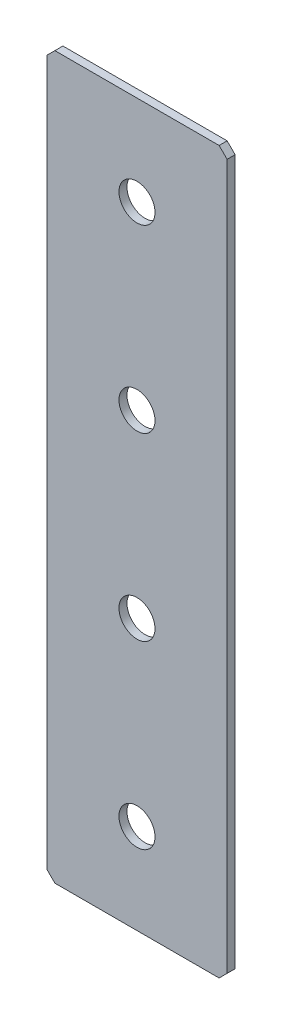
ISO-10303-21;
HEADER;
FILE_DESCRIPTION(('STEP AP214'),'2;1');
FILE_NAME('part.step','',(''),(''),'','','');
FILE_SCHEMA(('AUTOMOTIVE_DESIGN { 1 0 10303 214 1 1 1 1 }'));
ENDSEC;
DATA;
#1=APPLICATION_CONTEXT('core data for automotive mechanical design processes');
#2=APPLICATION_PROTOCOL_DEFINITION('international standard','automotive_design',2000,#1);
#3=PRODUCT_CONTEXT('',#1,'mechanical');
#4=PRODUCT('Part','Part','',(#3));
#5=PRODUCT_RELATED_PRODUCT_CATEGORY('part','',(#4));
#6=PRODUCT_DEFINITION_FORMATION('','',#4);
#7=PRODUCT_DEFINITION_CONTEXT('part definition',#1,'design');
#8=PRODUCT_DEFINITION('design','',#6,#7);
#9=PRODUCT_DEFINITION_SHAPE('','',#8);
#10=(LENGTH_UNIT() NAMED_UNIT(*) SI_UNIT(.MILLI.,.METRE.));
#11=(NAMED_UNIT(*) PLANE_ANGLE_UNIT() SI_UNIT($,.RADIAN.));
#12=(NAMED_UNIT(*) SI_UNIT($,.STERADIAN.) SOLID_ANGLE_UNIT());
#13=UNCERTAINTY_MEASURE_WITH_UNIT(LENGTH_MEASURE(1.E-05),#10,'distance_accuracy_value','');
#14=(GEOMETRIC_REPRESENTATION_CONTEXT(3) GLOBAL_UNCERTAINTY_ASSIGNED_CONTEXT((#13)) GLOBAL_UNIT_ASSIGNED_CONTEXT((#10,
#11,#12)) REPRESENTATION_CONTEXT('',''));
#15=CARTESIAN_POINT('',(0.,0.,0.));
#16=DIRECTION('',(0.,0.,1.));
#17=DIRECTION('',(1.,0.,0.));
#18=AXIS2_PLACEMENT_3D('',#15,#16,#17);
#19=CARTESIAN_POINT('',(22.5,-90.,2.));
#20=DIRECTION('',(-1.,0.,0.));
#21=DIRECTION('',(0.,0.,1.));
#22=AXIS2_PLACEMENT_3D('',#19,#20,#21);
#23=PLANE('',#22);
#24=DIRECTION('',(0.,1.,0.));
#25=VECTOR('',#24,1.);
#26=CARTESIAN_POINT('',(22.5,-90.,2.));
#27=LINE('',#26,#25);
#28=CARTESIAN_POINT('',(22.5,-88.,2.));
#29=VERTEX_POINT('',#28);
#30=CARTESIAN_POINT('',(22.5,87.9999999999999,2.));
#31=VERTEX_POINT('',#30);
#32=EDGE_CURVE('E128',#29,#31,#27,.T.);
#33=ORIENTED_EDGE('',*,*,#32,.F.);
#34=DIRECTION('',(0.,0.,-1.));
#35=VECTOR('',#34,1.);
#36=CARTESIAN_POINT('',(22.5,-88.,2.));
#37=LINE('',#36,#35);
#38=CARTESIAN_POINT('',(22.5,-88.,0.));
#39=VERTEX_POINT('',#38);
#40=EDGE_CURVE('E154',#29,#39,#37,.T.);
#41=ORIENTED_EDGE('',*,*,#40,.T.);
#42=DIRECTION('',(0.,1.,0.));
#43=VECTOR('',#42,1.);
#44=CARTESIAN_POINT('',(22.5,-90.,0.));
#45=LINE('',#44,#43);
#46=CARTESIAN_POINT('',(22.5,87.9999999999999,0.));
#47=VERTEX_POINT('',#46);
#48=EDGE_CURVE('E162',#39,#47,#45,.T.);
#49=ORIENTED_EDGE('',*,*,#48,.T.);
#50=DIRECTION('',(0.,0.,1.));
#51=VECTOR('',#50,1.);
#52=CARTESIAN_POINT('',(22.5,88.,2.));
#53=LINE('',#52,#51);
#54=EDGE_CURVE('E152',#47,#31,#53,.T.);
#55=ORIENTED_EDGE('',*,*,#54,.T.);
#56=EDGE_LOOP('',(#33,#41,#49,#55));
#57=FACE_BOUND('',#56,.T.);
#58=ADVANCED_FACE('F37',(#57),#23,.F.);
#59=CARTESIAN_POINT('',(-22.5,90.,2.));
#60=DIRECTION('',(0.,-1.,0.));
#61=DIRECTION('',(0.,0.,-1.));
#62=AXIS2_PLACEMENT_3D('',#59,#60,#61);
#63=PLANE('',#62);
#64=DIRECTION('',(-1.,0.,0.));
#65=VECTOR('',#64,1.);
#66=CARTESIAN_POINT('',(-22.5,90.,0.));
#67=LINE('',#66,#65);
#68=CARTESIAN_POINT('',(20.5,90.,0.));
#69=VERTEX_POINT('',#68);
#70=CARTESIAN_POINT('',(-20.5,90.,0.));
#71=VERTEX_POINT('',#70);
#72=EDGE_CURVE('E133',#69,#71,#67,.T.);
#73=ORIENTED_EDGE('',*,*,#72,.T.);
#74=DIRECTION('',(0.,0.,1.));
#75=VECTOR('',#74,1.);
#76=CARTESIAN_POINT('',(-20.5,90.,2.));
#77=LINE('',#76,#75);
#78=CARTESIAN_POINT('',(-20.5,90.,2.));
#79=VERTEX_POINT('',#78);
#80=EDGE_CURVE('E11',#71,#79,#77,.T.);
#81=ORIENTED_EDGE('',*,*,#80,.T.);
#82=DIRECTION('',(-1.,0.,0.));
#83=VECTOR('',#82,1.);
#84=CARTESIAN_POINT('',(-22.5,90.,2.));
#85=LINE('',#84,#83);
#86=CARTESIAN_POINT('',(20.5,90.,2.));
#87=VERTEX_POINT('',#86);
#88=EDGE_CURVE('E131',#87,#79,#85,.T.);
#89=ORIENTED_EDGE('',*,*,#88,.F.);
#90=DIRECTION('',(0.,0.,-1.));
#91=VECTOR('',#90,1.);
#92=CARTESIAN_POINT('',(20.5,90.,2.));
#93=LINE('',#92,#91);
#94=EDGE_CURVE('E45',#87,#69,#93,.T.);
#95=ORIENTED_EDGE('',*,*,#94,.T.);
#96=EDGE_LOOP('',(#73,#81,#89,#95));
#97=FACE_BOUND('',#96,.T.);
#98=ADVANCED_FACE('F159',(#97),#63,.F.);
#99=CARTESIAN_POINT('',(-22.5,-90.,2.));
#100=DIRECTION('',(1.,0.,0.));
#101=DIRECTION('',(0.,0.,-1.));
#102=AXIS2_PLACEMENT_3D('',#99,#100,#101);
#103=PLANE('',#102);
#104=DIRECTION('',(0.,-1.,0.));
#105=VECTOR('',#104,1.);
#106=CARTESIAN_POINT('',(-22.5,-90.,0.));
#107=LINE('',#106,#105);
#108=CARTESIAN_POINT('',(-22.5,88.,0.));
#109=VERTEX_POINT('',#108);
#110=CARTESIAN_POINT('',(-22.5,-88.,0.));
#111=VERTEX_POINT('',#110);
#112=EDGE_CURVE('E129',#109,#111,#107,.T.);
#113=ORIENTED_EDGE('',*,*,#112,.T.);
#114=DIRECTION('',(0.,0.,1.));
#115=VECTOR('',#114,1.);
#116=CARTESIAN_POINT('',(-22.5,-88.,2.));
#117=LINE('',#116,#115);
#118=CARTESIAN_POINT('',(-22.5,-88.,2.));
#119=VERTEX_POINT('',#118);
#120=EDGE_CURVE('E107',#111,#119,#117,.T.);
#121=ORIENTED_EDGE('',*,*,#120,.T.);
#122=DIRECTION('',(0.,-1.,0.));
#123=VECTOR('',#122,1.);
#124=CARTESIAN_POINT('',(-22.5,-90.,2.));
#125=LINE('',#124,#123);
#126=CARTESIAN_POINT('',(-22.5,88.,2.));
#127=VERTEX_POINT('',#126);
#128=EDGE_CURVE('E167',#127,#119,#125,.T.);
#129=ORIENTED_EDGE('',*,*,#128,.F.);
#130=DIRECTION('',(0.,0.,-1.));
#131=VECTOR('',#130,1.);
#132=CARTESIAN_POINT('',(-22.5,88.,2.));
#133=LINE('',#132,#131);
#134=EDGE_CURVE('E112',#127,#109,#133,.T.);
#135=ORIENTED_EDGE('',*,*,#134,.T.);
#136=EDGE_LOOP('',(#113,#121,#129,#135));
#137=FACE_BOUND('',#136,.T.);
#138=ADVANCED_FACE('F210',(#137),#103,.F.);
#139=CARTESIAN_POINT('',(-22.5,-90.,2.));
#140=DIRECTION('',(0.,1.,0.));
#141=DIRECTION('',(0.,0.,1.));
#142=AXIS2_PLACEMENT_3D('',#139,#140,#141);
#143=PLANE('',#142);
#144=DIRECTION('',(1.,0.,0.));
#145=VECTOR('',#144,1.);
#146=CARTESIAN_POINT('',(-22.5,-90.,2.));
#147=LINE('',#146,#145);
#148=CARTESIAN_POINT('',(-20.5,-90.,2.));
#149=VERTEX_POINT('',#148);
#150=CARTESIAN_POINT('',(20.5,-90.,2.));
#151=VERTEX_POINT('',#150);
#152=EDGE_CURVE('E122',#149,#151,#147,.T.);
#153=ORIENTED_EDGE('',*,*,#152,.F.);
#154=DIRECTION('',(0.,0.,-1.));
#155=VECTOR('',#154,1.);
#156=CARTESIAN_POINT('',(-20.5,-90.,2.));
#157=LINE('',#156,#155);
#158=CARTESIAN_POINT('',(-20.5,-90.,0.));
#159=VERTEX_POINT('',#158);
#160=EDGE_CURVE('E106',#149,#159,#157,.T.);
#161=ORIENTED_EDGE('',*,*,#160,.T.);
#162=DIRECTION('',(1.,0.,0.));
#163=VECTOR('',#162,1.);
#164=CARTESIAN_POINT('',(-22.5,-90.,0.));
#165=LINE('',#164,#163);
#166=CARTESIAN_POINT('',(20.5,-90.,0.));
#167=VERTEX_POINT('',#166);
#168=EDGE_CURVE('E119',#159,#167,#165,.T.);
#169=ORIENTED_EDGE('',*,*,#168,.T.);
#170=DIRECTION('',(0.,0.,1.));
#171=VECTOR('',#170,1.);
#172=CARTESIAN_POINT('',(20.5,-90.,2.));
#173=LINE('',#172,#171);
#174=EDGE_CURVE('E124',#167,#151,#173,.T.);
#175=ORIENTED_EDGE('',*,*,#174,.T.);
#176=EDGE_LOOP('',(#153,#161,#169,#175));
#177=FACE_BOUND('',#176,.T.);
#178=ADVANCED_FACE('F118',(#177),#143,.F.);
#179=CARTESIAN_POINT('',(0.,0.,2.));
#180=DIRECTION('',(0.,0.,-1.));
#181=DIRECTION('',(-1.,0.,0.));
#182=AXIS2_PLACEMENT_3D('',#179,#180,#181);
#183=PLANE('',#182);
#184=CARTESIAN_POINT('',(0.,67.5,2.));
#185=DIRECTION('',(0.,0.,1.));
#186=DIRECTION('',(1.,0.,0.));
#187=AXIS2_PLACEMENT_3D('',#184,#185,#186);
#188=CIRCLE('',#187,4.5);
#189=CARTESIAN_POINT('',(4.5,67.5,2.));
#190=VERTEX_POINT('',#189);
#191=EDGE_CURVE('E191',#190,#190,#188,.T.);
#192=ORIENTED_EDGE('',*,*,#191,.F.);
#193=EDGE_LOOP('',(#192));
#194=FACE_BOUND('',#193,.T.);
#195=CARTESIAN_POINT('',(0.,22.5,2.));
#196=DIRECTION('',(0.,0.,1.));
#197=DIRECTION('',(1.,0.,0.));
#198=AXIS2_PLACEMENT_3D('',#195,#196,#197);
#199=CIRCLE('',#198,4.5);
#200=CARTESIAN_POINT('',(4.50000000000001,22.5,2.));
#201=VERTEX_POINT('',#200);
#202=EDGE_CURVE('E185',#201,#201,#199,.T.);
#203=ORIENTED_EDGE('',*,*,#202,.F.);
#204=EDGE_LOOP('',(#203));
#205=FACE_BOUND('',#204,.T.);
#206=CARTESIAN_POINT('',(0.,-22.5,2.));
#207=DIRECTION('',(0.,0.,1.));
#208=DIRECTION('',(1.,0.,0.));
#209=AXIS2_PLACEMENT_3D('',#206,#207,#208);
#210=CIRCLE('',#209,4.5);
#211=CARTESIAN_POINT('',(4.5,-22.5,2.));
#212=VERTEX_POINT('',#211);
#213=EDGE_CURVE('E179',#212,#212,#210,.T.);
#214=ORIENTED_EDGE('',*,*,#213,.F.);
#215=EDGE_LOOP('',(#214));
#216=FACE_BOUND('',#215,.T.);
#217=CARTESIAN_POINT('',(0.,-67.5,2.));
#218=DIRECTION('',(0.,0.,1.));
#219=DIRECTION('',(1.,0.,0.));
#220=AXIS2_PLACEMENT_3D('',#217,#218,#219);
#221=CIRCLE('',#220,4.5);
#222=CARTESIAN_POINT('',(4.50000000000001,-67.5,2.));
#223=VERTEX_POINT('',#222);
#224=EDGE_CURVE('E173',#223,#223,#221,.T.);
#225=ORIENTED_EDGE('',*,*,#224,.F.);
#226=EDGE_LOOP('',(#225));
#227=FACE_BOUND('',#226,.T.);
#228=ORIENTED_EDGE('',*,*,#128,.T.);
#229=DIRECTION('',(-0.707106781186543,0.707106781186552,0.));
#230=VECTOR('',#229,1.);
#231=CARTESIAN_POINT('',(-20.5,-90.,2.));
#232=LINE('',#231,#230);
#233=EDGE_CURVE('E150',#119,#149,#232,.F.);
#234=ORIENTED_EDGE('',*,*,#233,.T.);
#235=ORIENTED_EDGE('',*,*,#152,.T.);
#236=DIRECTION('',(-0.707106781186552,-0.707106781186543,0.));
#237=VECTOR('',#236,1.);
#238=CARTESIAN_POINT('',(22.5,-88.,2.));
#239=LINE('',#238,#237);
#240=EDGE_CURVE('E148',#151,#29,#239,.F.);
#241=ORIENTED_EDGE('',*,*,#240,.T.);
#242=ORIENTED_EDGE('',*,*,#32,.T.);
#243=DIRECTION('',(0.707106781186543,-0.707106781186552,0.));
#244=VECTOR('',#243,1.);
#245=CARTESIAN_POINT('',(20.5,90.,2.));
#246=LINE('',#245,#244);
#247=EDGE_CURVE('E57',#31,#87,#246,.F.);
#248=ORIENTED_EDGE('',*,*,#247,.T.);
#249=ORIENTED_EDGE('',*,*,#88,.T.);
#250=DIRECTION('',(0.707106781186552,0.707106781186543,0.));
#251=VECTOR('',#250,1.);
#252=CARTESIAN_POINT('',(-22.5,88.,2.));
#253=LINE('',#252,#251);
#254=EDGE_CURVE('E146',#79,#127,#253,.F.);
#255=ORIENTED_EDGE('',*,*,#254,.T.);
#256=EDGE_LOOP('',(#228,#234,#235,#241,#242,#248,#249,#255));
#257=FACE_BOUND('',#256,.T.);
#258=ADVANCED_FACE('F197',(#194,#205,#216,#227,#257),#183,.F.);
#259=CARTESIAN_POINT('',(0.,0.,0.));
#260=DIRECTION('',(0.,0.,-1.));
#261=DIRECTION('',(-1.,0.,0.));
#262=AXIS2_PLACEMENT_3D('',#259,#260,#261);
#263=PLANE('',#262);
#264=CARTESIAN_POINT('',(0.,67.5,0.));
#265=DIRECTION('',(0.,0.,1.));
#266=DIRECTION('',(1.,0.,0.));
#267=AXIS2_PLACEMENT_3D('',#264,#265,#266);
#268=CIRCLE('',#267,4.5);
#269=CARTESIAN_POINT('',(4.5,67.5,0.));
#270=VERTEX_POINT('',#269);
#271=EDGE_CURVE('E188',#270,#270,#268,.T.);
#272=ORIENTED_EDGE('',*,*,#271,.T.);
#273=EDGE_LOOP('',(#272));
#274=FACE_BOUND('',#273,.T.);
#275=CARTESIAN_POINT('',(0.,22.5,0.));
#276=DIRECTION('',(0.,0.,1.));
#277=DIRECTION('',(1.,0.,0.));
#278=AXIS2_PLACEMENT_3D('',#275,#276,#277);
#279=CIRCLE('',#278,4.5);
#280=CARTESIAN_POINT('',(4.50000000000001,22.5,0.));
#281=VERTEX_POINT('',#280);
#282=EDGE_CURVE('E182',#281,#281,#279,.T.);
#283=ORIENTED_EDGE('',*,*,#282,.T.);
#284=EDGE_LOOP('',(#283));
#285=FACE_BOUND('',#284,.T.);
#286=CARTESIAN_POINT('',(0.,-22.5,0.));
#287=DIRECTION('',(0.,0.,1.));
#288=DIRECTION('',(1.,0.,0.));
#289=AXIS2_PLACEMENT_3D('',#286,#287,#288);
#290=CIRCLE('',#289,4.5);
#291=CARTESIAN_POINT('',(4.5,-22.5,0.));
#292=VERTEX_POINT('',#291);
#293=EDGE_CURVE('E176',#292,#292,#290,.T.);
#294=ORIENTED_EDGE('',*,*,#293,.T.);
#295=EDGE_LOOP('',(#294));
#296=FACE_BOUND('',#295,.T.);
#297=CARTESIAN_POINT('',(0.,-67.5,0.));
#298=DIRECTION('',(0.,0.,1.));
#299=DIRECTION('',(1.,0.,0.));
#300=AXIS2_PLACEMENT_3D('',#297,#298,#299);
#301=CIRCLE('',#300,4.5);
#302=CARTESIAN_POINT('',(4.50000000000001,-67.5,0.));
#303=VERTEX_POINT('',#302);
#304=EDGE_CURVE('E163',#303,#303,#301,.T.);
#305=ORIENTED_EDGE('',*,*,#304,.T.);
#306=EDGE_LOOP('',(#305));
#307=FACE_BOUND('',#306,.T.);
#308=ORIENTED_EDGE('',*,*,#168,.F.);
#309=DIRECTION('',(0.707106781186543,-0.707106781186552,0.));
#310=VECTOR('',#309,1.);
#311=CARTESIAN_POINT('',(-55.2500000000002,-55.2499999999994,0.));
#312=LINE('',#311,#310);
#313=EDGE_CURVE('E102',#159,#111,#312,.F.);
#314=ORIENTED_EDGE('',*,*,#313,.T.);
#315=ORIENTED_EDGE('',*,*,#112,.F.);
#316=DIRECTION('',(-0.707106781186552,-0.707106781186543,0.));
#317=VECTOR('',#316,1.);
#318=CARTESIAN_POINT('',(-55.2499999999999,55.2500000000006,0.));
#319=LINE('',#318,#317);
#320=EDGE_CURVE('E139',#109,#71,#319,.F.);
#321=ORIENTED_EDGE('',*,*,#320,.T.);
#322=ORIENTED_EDGE('',*,*,#72,.F.);
#323=DIRECTION('',(-0.707106781186543,0.707106781186552,0.));
#324=VECTOR('',#323,1.);
#325=CARTESIAN_POINT('',(55.2500000000002,55.2499999999994,0.));
#326=LINE('',#325,#324);
#327=EDGE_CURVE('E123',#69,#47,#326,.F.);
#328=ORIENTED_EDGE('',*,*,#327,.T.);
#329=ORIENTED_EDGE('',*,*,#48,.F.);
#330=DIRECTION('',(0.707106781186552,0.707106781186543,0.));
#331=VECTOR('',#330,1.);
#332=CARTESIAN_POINT('',(55.2499999999999,-55.2500000000006,0.));
#333=LINE('',#332,#331);
#334=EDGE_CURVE('E113',#39,#167,#333,.F.);
#335=ORIENTED_EDGE('',*,*,#334,.T.);
#336=EDGE_LOOP('',(#308,#314,#315,#321,#322,#328,#329,#335));
#337=FACE_BOUND('',#336,.T.);
#338=ADVANCED_FACE('F126',(#274,#285,#296,#307,#337),#263,.T.);
#339=CARTESIAN_POINT('',(-20.5,-90.,2.));
#340=DIRECTION('',(0.707106781186552,0.707106781186543,0.));
#341=DIRECTION('',(0.,0.,-1.));
#342=AXIS2_PLACEMENT_3D('',#339,#340,#341);
#343=PLANE('',#342);
#344=ORIENTED_EDGE('',*,*,#233,.F.);
#345=ORIENTED_EDGE('',*,*,#120,.F.);
#346=ORIENTED_EDGE('',*,*,#313,.F.);
#347=ORIENTED_EDGE('',*,*,#160,.F.);
#348=EDGE_LOOP('',(#344,#345,#346,#347));
#349=FACE_BOUND('',#348,.T.);
#350=ADVANCED_FACE('F105',(#349),#343,.F.);
#351=CARTESIAN_POINT('',(22.5,-88.,2.));
#352=DIRECTION('',(-0.707106781186543,0.707106781186552,0.));
#353=DIRECTION('',(0.,0.,-1.));
#354=AXIS2_PLACEMENT_3D('',#351,#352,#353);
#355=PLANE('',#354);
#356=ORIENTED_EDGE('',*,*,#240,.F.);
#357=ORIENTED_EDGE('',*,*,#174,.F.);
#358=ORIENTED_EDGE('',*,*,#334,.F.);
#359=ORIENTED_EDGE('',*,*,#40,.F.);
#360=EDGE_LOOP('',(#356,#357,#358,#359));
#361=FACE_BOUND('',#360,.T.);
#362=ADVANCED_FACE('F214',(#361),#355,.F.);
#363=CARTESIAN_POINT('',(-22.5,88.,2.));
#364=DIRECTION('',(0.707106781186543,-0.707106781186552,0.));
#365=DIRECTION('',(0.,0.,-1.));
#366=AXIS2_PLACEMENT_3D('',#363,#364,#365);
#367=PLANE('',#366);
#368=ORIENTED_EDGE('',*,*,#254,.F.);
#369=ORIENTED_EDGE('',*,*,#80,.F.);
#370=ORIENTED_EDGE('',*,*,#320,.F.);
#371=ORIENTED_EDGE('',*,*,#134,.F.);
#372=EDGE_LOOP('',(#368,#369,#370,#371));
#373=FACE_BOUND('',#372,.T.);
#374=ADVANCED_FACE('F212',(#373),#367,.F.);
#375=CARTESIAN_POINT('',(20.5,90.,2.));
#376=DIRECTION('',(-0.707106781186552,-0.707106781186543,0.));
#377=DIRECTION('',(0.,0.,-1.));
#378=AXIS2_PLACEMENT_3D('',#375,#376,#377);
#379=PLANE('',#378);
#380=ORIENTED_EDGE('',*,*,#247,.F.);
#381=ORIENTED_EDGE('',*,*,#54,.F.);
#382=ORIENTED_EDGE('',*,*,#327,.F.);
#383=ORIENTED_EDGE('',*,*,#94,.F.);
#384=EDGE_LOOP('',(#380,#381,#382,#383));
#385=FACE_BOUND('',#384,.T.);
#386=ADVANCED_FACE('F39',(#385),#379,.F.);
#387=CARTESIAN_POINT('',(0.,-67.5,2.));
#388=DIRECTION('',(0.,0.,1.));
#389=DIRECTION('',(1.,0.,0.));
#390=AXIS2_PLACEMENT_3D('',#387,#388,#389);
#391=CYLINDRICAL_SURFACE('',#390,4.5);
#392=ORIENTED_EDGE('',*,*,#304,.F.);
#393=EDGE_LOOP('',(#392));
#394=FACE_BOUND('',#393,.T.);
#395=ORIENTED_EDGE('',*,*,#224,.T.);
#396=EDGE_LOOP('',(#395));
#397=FACE_BOUND('',#396,.T.);
#398=ADVANCED_FACE('F219',(#394,#397),#391,.F.);
#399=CARTESIAN_POINT('',(0.,-22.5,2.));
#400=DIRECTION('',(0.,0.,1.));
#401=DIRECTION('',(1.,0.,0.));
#402=AXIS2_PLACEMENT_3D('',#399,#400,#401);
#403=CYLINDRICAL_SURFACE('',#402,4.5);
#404=ORIENTED_EDGE('',*,*,#293,.F.);
#405=EDGE_LOOP('',(#404));
#406=FACE_BOUND('',#405,.T.);
#407=ORIENTED_EDGE('',*,*,#213,.T.);
#408=EDGE_LOOP('',(#407));
#409=FACE_BOUND('',#408,.T.);
#410=ADVANCED_FACE('F274',(#406,#409),#403,.F.);
#411=CARTESIAN_POINT('',(0.,22.5,2.));
#412=DIRECTION('',(0.,0.,1.));
#413=DIRECTION('',(1.,0.,0.));
#414=AXIS2_PLACEMENT_3D('',#411,#412,#413);
#415=CYLINDRICAL_SURFACE('',#414,4.5);
#416=ORIENTED_EDGE('',*,*,#282,.F.);
#417=EDGE_LOOP('',(#416));
#418=FACE_BOUND('',#417,.T.);
#419=ORIENTED_EDGE('',*,*,#202,.T.);
#420=EDGE_LOOP('',(#419));
#421=FACE_BOUND('',#420,.T.);
#422=ADVANCED_FACE('F283',(#418,#421),#415,.F.);
#423=CARTESIAN_POINT('',(0.,67.5,2.));
#424=DIRECTION('',(0.,0.,1.));
#425=DIRECTION('',(1.,0.,0.));
#426=AXIS2_PLACEMENT_3D('',#423,#424,#425);
#427=CYLINDRICAL_SURFACE('',#426,4.5);
#428=ORIENTED_EDGE('',*,*,#271,.F.);
#429=EDGE_LOOP('',(#428));
#430=FACE_BOUND('',#429,.T.);
#431=ORIENTED_EDGE('',*,*,#191,.T.);
#432=EDGE_LOOP('',(#431));
#433=FACE_BOUND('',#432,.T.);
#434=ADVANCED_FACE('F195',(#430,#433),#427,.F.);
#435=CLOSED_SHELL('',(#58,#98,#138,#178,#258,#338,#350,#362,#374,#386,#398,#410,#422,#434));
#436=MANIFOLD_SOLID_BREP('B2',#435);
#437=ADVANCED_BREP_SHAPE_REPRESENTATION('',(#18,#436),#14);
#438=SHAPE_DEFINITION_REPRESENTATION(#9,#437);
ENDSEC;
END-ISO-10303-21;
